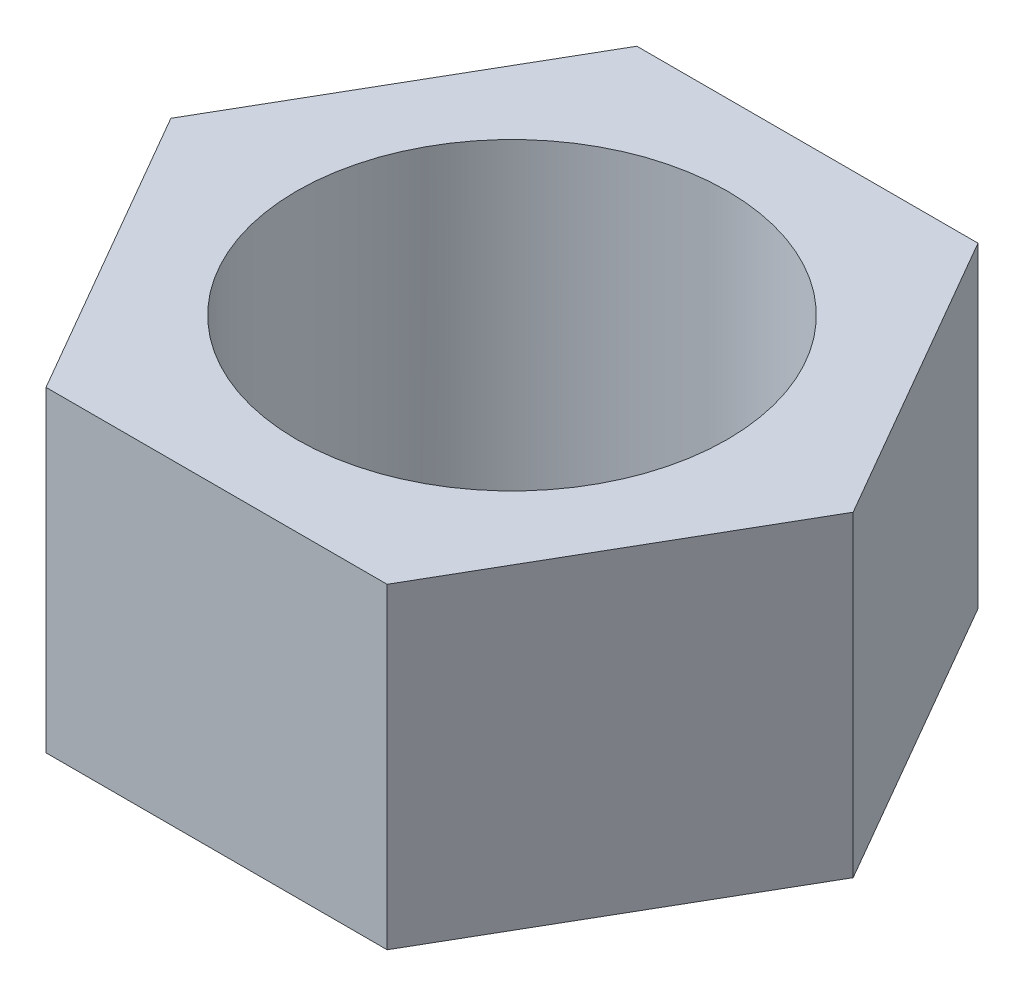
ISO-10303-21;
HEADER;
FILE_DESCRIPTION(('STEP AP214'),'2;1');
FILE_NAME('part.step','',(''),(''),'','','');
FILE_SCHEMA(('AUTOMOTIVE_DESIGN { 1 0 10303 214 1 1 1 1 }'));
ENDSEC;
DATA;
#1=APPLICATION_CONTEXT('core data for automotive mechanical design processes');
#2=APPLICATION_PROTOCOL_DEFINITION('international standard','automotive_design',2000,#1);
#3=PRODUCT_CONTEXT('',#1,'mechanical');
#4=PRODUCT('Part','Part','',(#3));
#5=PRODUCT_RELATED_PRODUCT_CATEGORY('part','',(#4));
#6=PRODUCT_DEFINITION_FORMATION('','',#4);
#7=PRODUCT_DEFINITION_CONTEXT('part definition',#1,'design');
#8=PRODUCT_DEFINITION('design','',#6,#7);
#9=PRODUCT_DEFINITION_SHAPE('','',#8);
#10=(LENGTH_UNIT() NAMED_UNIT(*) SI_UNIT(.MILLI.,.METRE.));
#11=(NAMED_UNIT(*) PLANE_ANGLE_UNIT() SI_UNIT($,.RADIAN.));
#12=(NAMED_UNIT(*) SI_UNIT($,.STERADIAN.) SOLID_ANGLE_UNIT());
#13=UNCERTAINTY_MEASURE_WITH_UNIT(LENGTH_MEASURE(1.E-05),#10,'distance_accuracy_value','');
#14=(GEOMETRIC_REPRESENTATION_CONTEXT(3) GLOBAL_UNCERTAINTY_ASSIGNED_CONTEXT((#13)) GLOBAL_UNIT_ASSIGNED_CONTEXT((#10,
#11,#12)) REPRESENTATION_CONTEXT('',''));
#15=CARTESIAN_POINT('',(0.,0.,0.));
#16=DIRECTION('',(0.,0.,1.));
#17=DIRECTION('',(1.,0.,0.));
#18=AXIS2_PLACEMENT_3D('',#15,#16,#17);
#19=CARTESIAN_POINT('',(2.02072594216369,3.75,3.5));
#20=DIRECTION('',(-0.866025403784439,0.,-0.499999999999999));
#21=DIRECTION('',(-0.5,0.,0.866025403784439));
#22=AXIS2_PLACEMENT_3D('',#19,#20,#21);
#23=PLANE('',#22);
#24=DIRECTION('',(0.5,0.,-0.866025403784439));
#25=VECTOR('',#24,1.);
#26=CARTESIAN_POINT('',(2.02072594216369,0.,3.5));
#27=LINE('',#26,#25);
#28=CARTESIAN_POINT('',(2.02072594216369,0.,3.5));
#29=VERTEX_POINT('',#28);
#30=CARTESIAN_POINT('',(4.04145188432738,0.,0.));
#31=VERTEX_POINT('',#30);
#32=EDGE_CURVE('E117',#29,#31,#27,.T.);
#33=ORIENTED_EDGE('',*,*,#32,.T.);
#34=DIRECTION('',(0.,-1.,0.));
#35=VECTOR('',#34,1.);
#36=CARTESIAN_POINT('',(4.04145188432738,3.75,0.));
#37=LINE('',#36,#35);
#38=CARTESIAN_POINT('',(4.04145188432738,3.75,0.));
#39=VERTEX_POINT('',#38);
#40=EDGE_CURVE('E11',#39,#31,#37,.T.);
#41=ORIENTED_EDGE('',*,*,#40,.F.);
#42=DIRECTION('',(0.5,0.,-0.866025403784439));
#43=VECTOR('',#42,1.);
#44=CARTESIAN_POINT('',(2.02072594216369,3.75,3.5));
#45=LINE('',#44,#43);
#46=CARTESIAN_POINT('',(2.02072594216369,3.75,3.5));
#47=VERTEX_POINT('',#46);
#48=EDGE_CURVE('E128',#47,#39,#45,.T.);
#49=ORIENTED_EDGE('',*,*,#48,.F.);
#50=DIRECTION('',(0.,-1.,0.));
#51=VECTOR('',#50,1.);
#52=CARTESIAN_POINT('',(2.02072594216369,3.75,3.5));
#53=LINE('',#52,#51);
#54=EDGE_CURVE('E113',#47,#29,#53,.T.);
#55=ORIENTED_EDGE('',*,*,#54,.T.);
#56=EDGE_LOOP('',(#33,#41,#49,#55));
#57=FACE_BOUND('',#56,.T.);
#58=ADVANCED_FACE('F33',(#57),#23,.F.);
#59=CARTESIAN_POINT('',(4.04145188432738,3.75,0.));
#60=DIRECTION('',(-0.866025403784438,0.,0.5));
#61=DIRECTION('',(0.5,0.,0.866025403784439));
#62=AXIS2_PLACEMENT_3D('',#59,#60,#61);
#63=PLANE('',#62);
#64=DIRECTION('',(-0.5,0.,-0.866025403784439));
#65=VECTOR('',#64,1.);
#66=CARTESIAN_POINT('',(4.04145188432738,0.,0.));
#67=LINE('',#66,#65);
#68=CARTESIAN_POINT('',(2.02072594216369,0.,-3.5));
#69=VERTEX_POINT('',#68);
#70=EDGE_CURVE('E120',#31,#69,#67,.T.);
#71=ORIENTED_EDGE('',*,*,#70,.T.);
#72=DIRECTION('',(0.,-1.,0.));
#73=VECTOR('',#72,1.);
#74=CARTESIAN_POINT('',(2.02072594216369,3.75,-3.5));
#75=LINE('',#74,#73);
#76=CARTESIAN_POINT('',(2.02072594216369,3.75,-3.5));
#77=VERTEX_POINT('',#76);
#78=EDGE_CURVE('E41',#77,#69,#75,.T.);
#79=ORIENTED_EDGE('',*,*,#78,.F.);
#80=DIRECTION('',(-0.5,0.,-0.866025403784439));
#81=VECTOR('',#80,1.);
#82=CARTESIAN_POINT('',(4.04145188432738,3.75,0.));
#83=LINE('',#82,#81);
#84=EDGE_CURVE('E86',#39,#77,#83,.T.);
#85=ORIENTED_EDGE('',*,*,#84,.F.);
#86=ORIENTED_EDGE('',*,*,#40,.T.);
#87=EDGE_LOOP('',(#71,#79,#85,#86));
#88=FACE_BOUND('',#87,.T.);
#89=ADVANCED_FACE('F153',(#88),#63,.F.);
#90=CARTESIAN_POINT('',(2.02072594216369,3.75,-3.5));
#91=DIRECTION('',(0.,0.,1.));
#92=DIRECTION('',(1.,0.,0.));
#93=AXIS2_PLACEMENT_3D('',#90,#91,#92);
#94=PLANE('',#93);
#95=DIRECTION('',(-1.,0.,0.));
#96=VECTOR('',#95,1.);
#97=CARTESIAN_POINT('',(2.02072594216369,0.,-3.5));
#98=LINE('',#97,#96);
#99=CARTESIAN_POINT('',(-2.02072594216369,0.,-3.5));
#100=VERTEX_POINT('',#99);
#101=EDGE_CURVE('E123',#69,#100,#98,.T.);
#102=ORIENTED_EDGE('',*,*,#101,.T.);
#103=DIRECTION('',(0.,-1.,0.));
#104=VECTOR('',#103,1.);
#105=CARTESIAN_POINT('',(-2.02072594216369,3.75,-3.5));
#106=LINE('',#105,#104);
#107=CARTESIAN_POINT('',(-2.02072594216369,3.75,-3.5));
#108=VERTEX_POINT('',#107);
#109=EDGE_CURVE('E108',#108,#100,#106,.T.);
#110=ORIENTED_EDGE('',*,*,#109,.F.);
#111=DIRECTION('',(-1.,0.,0.));
#112=VECTOR('',#111,1.);
#113=CARTESIAN_POINT('',(2.02072594216369,3.75,-3.5));
#114=LINE('',#113,#112);
#115=EDGE_CURVE('E99',#77,#108,#114,.T.);
#116=ORIENTED_EDGE('',*,*,#115,.F.);
#117=ORIENTED_EDGE('',*,*,#78,.T.);
#118=EDGE_LOOP('',(#102,#110,#116,#117));
#119=FACE_BOUND('',#118,.T.);
#120=ADVANCED_FACE('F134',(#119),#94,.F.);
#121=CARTESIAN_POINT('',(-2.02072594216369,3.75,-3.5));
#122=DIRECTION('',(0.866025403784439,0.,0.5));
#123=DIRECTION('',(0.5,0.,-0.866025403784439));
#124=AXIS2_PLACEMENT_3D('',#121,#122,#123);
#125=PLANE('',#124);
#126=DIRECTION('',(-0.5,0.,0.866025403784439));
#127=VECTOR('',#126,1.);
#128=CARTESIAN_POINT('',(-2.02072594216369,0.,-3.5));
#129=LINE('',#128,#127);
#130=CARTESIAN_POINT('',(-4.04145188432738,0.,0.));
#131=VERTEX_POINT('',#130);
#132=EDGE_CURVE('E107',#100,#131,#129,.T.);
#133=ORIENTED_EDGE('',*,*,#132,.T.);
#134=DIRECTION('',(0.,-1.,0.));
#135=VECTOR('',#134,1.);
#136=CARTESIAN_POINT('',(-4.04145188432738,3.75,0.));
#137=LINE('',#136,#135);
#138=CARTESIAN_POINT('',(-4.04145188432738,3.75,0.));
#139=VERTEX_POINT('',#138);
#140=EDGE_CURVE('E104',#139,#131,#137,.T.);
#141=ORIENTED_EDGE('',*,*,#140,.F.);
#142=DIRECTION('',(-0.5,0.,0.866025403784439));
#143=VECTOR('',#142,1.);
#144=CARTESIAN_POINT('',(-2.02072594216369,3.75,-3.5));
#145=LINE('',#144,#143);
#146=EDGE_CURVE('E93',#108,#139,#145,.T.);
#147=ORIENTED_EDGE('',*,*,#146,.F.);
#148=ORIENTED_EDGE('',*,*,#109,.T.);
#149=EDGE_LOOP('',(#133,#141,#147,#148));
#150=FACE_BOUND('',#149,.T.);
#151=ADVANCED_FACE('F105',(#150),#125,.F.);
#152=CARTESIAN_POINT('',(-4.04145188432738,3.75,0.));
#153=DIRECTION('',(0.866025403784439,0.,-0.5));
#154=DIRECTION('',(-0.5,0.,-0.866025403784439));
#155=AXIS2_PLACEMENT_3D('',#152,#153,#154);
#156=PLANE('',#155);
#157=DIRECTION('',(0.5,0.,0.866025403784439));
#158=VECTOR('',#157,1.);
#159=CARTESIAN_POINT('',(-4.04145188432738,0.,0.));
#160=LINE('',#159,#158);
#161=CARTESIAN_POINT('',(-2.02072594216369,0.,3.5));
#162=VERTEX_POINT('',#161);
#163=EDGE_CURVE('E72',#131,#162,#160,.T.);
#164=ORIENTED_EDGE('',*,*,#163,.T.);
#165=DIRECTION('',(0.,-1.,0.));
#166=VECTOR('',#165,1.);
#167=CARTESIAN_POINT('',(-2.02072594216369,3.75,3.5));
#168=LINE('',#167,#166);
#169=CARTESIAN_POINT('',(-2.02072594216369,3.75,3.5));
#170=VERTEX_POINT('',#169);
#171=EDGE_CURVE('E109',#170,#162,#168,.T.);
#172=ORIENTED_EDGE('',*,*,#171,.F.);
#173=DIRECTION('',(0.5,0.,0.866025403784439));
#174=VECTOR('',#173,1.);
#175=CARTESIAN_POINT('',(-4.04145188432738,3.75,0.));
#176=LINE('',#175,#174);
#177=EDGE_CURVE('E97',#139,#170,#176,.T.);
#178=ORIENTED_EDGE('',*,*,#177,.F.);
#179=ORIENTED_EDGE('',*,*,#140,.T.);
#180=EDGE_LOOP('',(#164,#172,#178,#179));
#181=FACE_BOUND('',#180,.T.);
#182=ADVANCED_FACE('F111',(#181),#156,.F.);
#183=CARTESIAN_POINT('',(-2.02072594216369,3.75,3.5));
#184=DIRECTION('',(0.,0.,-1.));
#185=DIRECTION('',(-1.,0.,0.));
#186=AXIS2_PLACEMENT_3D('',#183,#184,#185);
#187=PLANE('',#186);
#188=DIRECTION('',(1.,0.,0.));
#189=VECTOR('',#188,1.);
#190=CARTESIAN_POINT('',(-2.02072594216369,0.,3.5));
#191=LINE('',#190,#189);
#192=EDGE_CURVE('E78',#162,#29,#191,.T.);
#193=ORIENTED_EDGE('',*,*,#192,.T.);
#194=ORIENTED_EDGE('',*,*,#54,.F.);
#195=DIRECTION('',(1.,0.,0.));
#196=VECTOR('',#195,1.);
#197=CARTESIAN_POINT('',(-2.02072594216369,3.75,3.5));
#198=LINE('',#197,#196);
#199=EDGE_CURVE('E49',#170,#47,#198,.T.);
#200=ORIENTED_EDGE('',*,*,#199,.F.);
#201=ORIENTED_EDGE('',*,*,#171,.T.);
#202=EDGE_LOOP('',(#193,#194,#200,#201));
#203=FACE_BOUND('',#202,.T.);
#204=ADVANCED_FACE('F141',(#203),#187,.F.);
#205=CARTESIAN_POINT('',(0.,3.75,0.));
#206=DIRECTION('',(0.,1.,0.));
#207=DIRECTION('',(0.,0.,1.));
#208=AXIS2_PLACEMENT_3D('',#205,#206,#207);
#209=PLANE('',#208);
#210=CARTESIAN_POINT('',(0.,3.75,0.));
#211=DIRECTION('',(0.,1.,0.));
#212=DIRECTION('',(0.,0.,1.));
#213=AXIS2_PLACEMENT_3D('',#210,#211,#212);
#214=CIRCLE('',#213,2.55);
#215=CARTESIAN_POINT('',(0.,3.75,2.55));
#216=VERTEX_POINT('',#215);
#217=EDGE_CURVE('E121',#216,#216,#214,.T.);
#218=ORIENTED_EDGE('',*,*,#217,.F.);
#219=EDGE_LOOP('',(#218));
#220=FACE_BOUND('',#219,.T.);
#221=ORIENTED_EDGE('',*,*,#48,.T.);
#222=ORIENTED_EDGE('',*,*,#84,.T.);
#223=ORIENTED_EDGE('',*,*,#115,.T.);
#224=ORIENTED_EDGE('',*,*,#146,.T.);
#225=ORIENTED_EDGE('',*,*,#177,.T.);
#226=ORIENTED_EDGE('',*,*,#199,.T.);
#227=EDGE_LOOP('',(#221,#222,#223,#224,#225,#226));
#228=FACE_BOUND('',#227,.T.);
#229=ADVANCED_FACE('F95',(#220,#228),#209,.T.);
#230=CARTESIAN_POINT('',(0.,0.,0.));
#231=DIRECTION('',(0.,1.,0.));
#232=DIRECTION('',(0.,0.,1.));
#233=AXIS2_PLACEMENT_3D('',#230,#231,#232);
#234=PLANE('',#233);
#235=CARTESIAN_POINT('',(0.,0.,0.));
#236=DIRECTION('',(0.,-1.,0.));
#237=DIRECTION('',(0.,0.,-1.));
#238=AXIS2_PLACEMENT_3D('',#235,#236,#237);
#239=CIRCLE('',#238,2.55);
#240=CARTESIAN_POINT('',(0.,0.,-2.55));
#241=VERTEX_POINT('',#240);
#242=EDGE_CURVE('E208',#241,#241,#239,.T.);
#243=ORIENTED_EDGE('',*,*,#242,.F.);
#244=EDGE_LOOP('',(#243));
#245=FACE_BOUND('',#244,.T.);
#246=ORIENTED_EDGE('',*,*,#32,.F.);
#247=ORIENTED_EDGE('',*,*,#192,.F.);
#248=ORIENTED_EDGE('',*,*,#163,.F.);
#249=ORIENTED_EDGE('',*,*,#132,.F.);
#250=ORIENTED_EDGE('',*,*,#101,.F.);
#251=ORIENTED_EDGE('',*,*,#70,.F.);
#252=EDGE_LOOP('',(#246,#247,#248,#249,#250,#251));
#253=FACE_BOUND('',#252,.T.);
#254=ADVANCED_FACE('F137',(#245,#253),#234,.F.);
#255=CARTESIAN_POINT('',(0.,10.,0.));
#256=DIRECTION('',(0.,-1.,0.));
#257=DIRECTION('',(0.,0.,-1.));
#258=AXIS2_PLACEMENT_3D('',#255,#256,#257);
#259=CYLINDRICAL_SURFACE('',#258,2.55);
#260=ORIENTED_EDGE('',*,*,#217,.T.);
#261=EDGE_LOOP('',(#260));
#262=FACE_BOUND('',#261,.T.);
#263=ORIENTED_EDGE('',*,*,#242,.T.);
#264=EDGE_LOOP('',(#263));
#265=FACE_BOUND('',#264,.T.);
#266=ADVANCED_FACE('F190',(#262,#265),#259,.F.);
#267=CLOSED_SHELL('',(#58,#89,#120,#151,#182,#204,#229,#254,#266));
#268=MANIFOLD_SOLID_BREP('B2',#267);
#269=ADVANCED_BREP_SHAPE_REPRESENTATION('',(#18,#268),#14);
#270=SHAPE_DEFINITION_REPRESENTATION(#9,#269);
ENDSEC;
END-ISO-10303-21;
